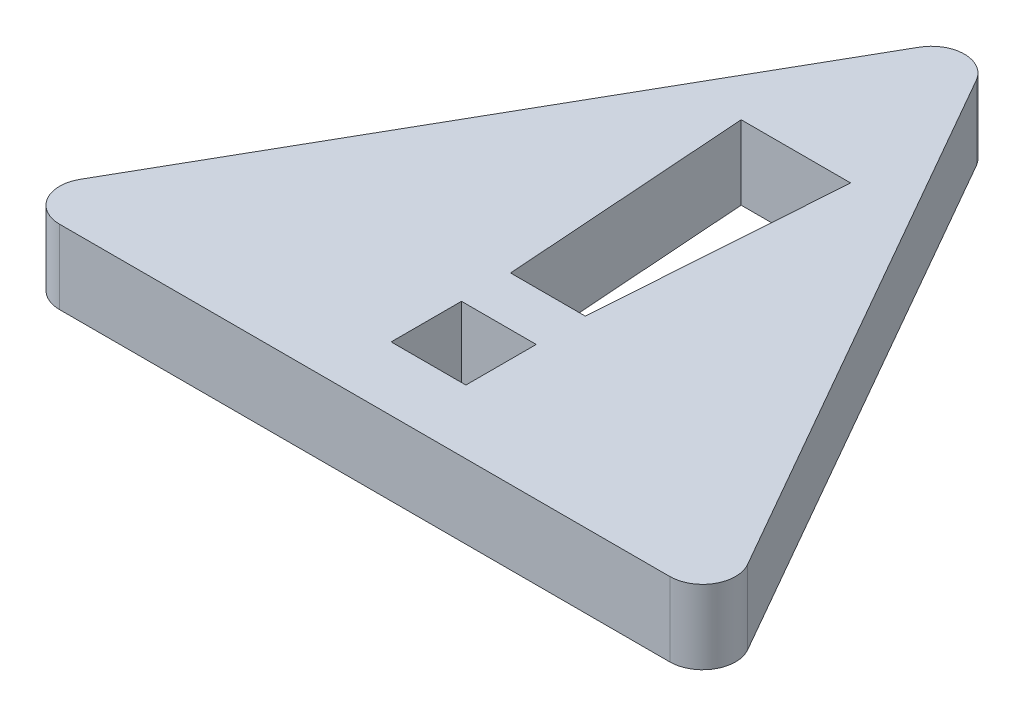
ISO-10303-21;
HEADER;
FILE_DESCRIPTION(('STEP AP214'),'2;1');
FILE_NAME('part.step','',(''),(''),'','','');
FILE_SCHEMA(('AUTOMOTIVE_DESIGN { 1 0 10303 214 1 1 1 1 }'));
ENDSEC;
DATA;
#1=APPLICATION_CONTEXT('core data for automotive mechanical design processes');
#2=APPLICATION_PROTOCOL_DEFINITION('international standard','automotive_design',2000,#1);
#3=PRODUCT_CONTEXT('',#1,'mechanical');
#4=PRODUCT('Part','Part','',(#3));
#5=PRODUCT_RELATED_PRODUCT_CATEGORY('part','',(#4));
#6=PRODUCT_DEFINITION_FORMATION('','',#4);
#7=PRODUCT_DEFINITION_CONTEXT('part definition',#1,'design');
#8=PRODUCT_DEFINITION('design','',#6,#7);
#9=PRODUCT_DEFINITION_SHAPE('','',#8);
#10=(LENGTH_UNIT() NAMED_UNIT(*) SI_UNIT(.MILLI.,.METRE.));
#11=(NAMED_UNIT(*) PLANE_ANGLE_UNIT() SI_UNIT($,.RADIAN.));
#12=(NAMED_UNIT(*) SI_UNIT($,.STERADIAN.) SOLID_ANGLE_UNIT());
#13=UNCERTAINTY_MEASURE_WITH_UNIT(LENGTH_MEASURE(1.E-05),#10,'distance_accuracy_value','');
#14=(GEOMETRIC_REPRESENTATION_CONTEXT(3) GLOBAL_UNCERTAINTY_ASSIGNED_CONTEXT((#13)) GLOBAL_UNIT_ASSIGNED_CONTEXT((#10,
#11,#12)) REPRESENTATION_CONTEXT('',''));
#15=CARTESIAN_POINT('',(0.,0.,0.));
#16=DIRECTION('',(0.,0.,1.));
#17=DIRECTION('',(1.,0.,0.));
#18=AXIS2_PLACEMENT_3D('',#15,#16,#17);
#19=CARTESIAN_POINT('',(0.,2.25,0.));
#20=DIRECTION('',(0.,-1.,0.));
#21=DIRECTION('',(0.,0.,-1.));
#22=AXIS2_PLACEMENT_3D('',#19,#20,#21);
#23=PLANE('',#22);
#24=DIRECTION('',(0.,0.,1.));
#25=VECTOR('',#24,1.);
#26=CARTESIAN_POINT('',(-7.26476447593346,2.25,-5.91742952927736));
#27=LINE('',#26,#25);
#28=CARTESIAN_POINT('',(-7.26476447593346,2.25,-5.91742952927736));
#29=VERTEX_POINT('',#28);
#30=CARTESIAN_POINT('',(-7.26476447593346,2.25,-3.77872924812318));
#31=VERTEX_POINT('',#30);
#32=EDGE_CURVE('E177',#29,#31,#27,.T.);
#33=ORIENTED_EDGE('',*,*,#32,.F.);
#34=DIRECTION('',(-1.,0.,0.));
#35=VECTOR('',#34,1.);
#36=CARTESIAN_POINT('',(-7.26476447593346,2.25,-5.91742952927736));
#37=LINE('',#36,#35);
#38=CARTESIAN_POINT('',(-4.99239542720714,2.25,-5.91742952927736));
#39=VERTEX_POINT('',#38);
#40=EDGE_CURVE('E185',#39,#29,#37,.T.);
#41=ORIENTED_EDGE('',*,*,#40,.F.);
#42=DIRECTION('',(0.,0.,-1.));
#43=VECTOR('',#42,1.);
#44=CARTESIAN_POINT('',(-4.99239542720714,2.25,-5.91742952927736));
#45=LINE('',#44,#43);
#46=CARTESIAN_POINT('',(-4.99239542720714,2.25,-3.77872924812318));
#47=VERTEX_POINT('',#46);
#48=EDGE_CURVE('E182',#47,#39,#45,.T.);
#49=ORIENTED_EDGE('',*,*,#48,.F.);
#50=DIRECTION('',(1.,0.,0.));
#51=VECTOR('',#50,1.);
#52=CARTESIAN_POINT('',(-7.26476447593346,2.25,-3.77872924812318));
#53=LINE('',#52,#51);
#54=EDGE_CURVE('E179',#31,#47,#53,.T.);
#55=ORIENTED_EDGE('',*,*,#54,.F.);
#56=EDGE_LOOP('',(#33,#41,#49,#55));
#57=FACE_BOUND('',#56,.T.);
#58=DIRECTION('',(-0.496138938356834,0.,0.868243142124459));
#59=VECTOR('',#58,1.);
#60=CARTESIAN_POINT('',(-17.1285799515703,2.25,-1.83754386538101));
#61=LINE('',#60,#59);
#62=CARTESIAN_POINT('',(-6.99682309369476,2.25,-19.5681183666632));
#63=VERTEX_POINT('',#62);
#64=CARTESIAN_POINT('',(-16.2736434153664,2.25,-3.33368280373785));
#65=VERTEX_POINT('',#64);
#66=EDGE_CURVE('E213',#63,#65,#61,.T.);
#67=ORIENTED_EDGE('',*,*,#66,.T.);
#68=CARTESIAN_POINT('',(-15.4054002732419,2.25,-2.83754386538101));
#69=DIRECTION('',(0.,-1.,0.));
#70=DIRECTION('',(0.,0.,-1.));
#71=AXIS2_PLACEMENT_3D('',#68,#69,#70);
#72=CIRCLE('',#71,1.);
#73=CARTESIAN_POINT('',(-15.4054002732419,2.25,-1.83754386538101));
#74=VERTEX_POINT('',#73);
#75=EDGE_CURVE('E241',#65,#74,#72,.F.);
#76=ORIENTED_EDGE('',*,*,#75,.T.);
#77=DIRECTION('',(1.,0.,0.));
#78=VECTOR('',#77,1.);
#79=CARTESIAN_POINT('',(4.8714200484297,2.25,-1.83754386538102));
#80=LINE('',#79,#78);
#81=CARTESIAN_POINT('',(3.14824037010133,2.25,-1.83754386538102));
#82=VERTEX_POINT('',#81);
#83=EDGE_CURVE('E208',#74,#82,#80,.T.);
#84=ORIENTED_EDGE('',*,*,#83,.T.);
#85=CARTESIAN_POINT('',(3.14824037010133,2.25,-2.83754386538102));
#86=DIRECTION('',(0.,-1.,0.));
#87=DIRECTION('',(0.,0.,-1.));
#88=AXIS2_PLACEMENT_3D('',#85,#86,#87);
#89=CIRCLE('',#88,1.);
#90=CARTESIAN_POINT('',(4.01648351222579,2.25,-3.33368280373785));
#91=VERTEX_POINT('',#90);
#92=EDGE_CURVE('E54',#82,#91,#89,.F.);
#93=ORIENTED_EDGE('',*,*,#92,.T.);
#94=DIRECTION('',(-0.496138938356834,0.,-0.868243142124459));
#95=VECTOR('',#94,1.);
#96=CARTESIAN_POINT('',(-6.1285799515703,2.25,-21.087543865381));
#97=LINE('',#96,#95);
#98=CARTESIAN_POINT('',(-5.26033680944584,2.25,-19.5681183666632));
#99=VERTEX_POINT('',#98);
#100=EDGE_CURVE('E210',#91,#99,#97,.T.);
#101=ORIENTED_EDGE('',*,*,#100,.T.);
#102=CARTESIAN_POINT('',(-6.1285799515703,2.25,-19.0719794283064));
#103=DIRECTION('',(0.,-1.,0.));
#104=DIRECTION('',(0.,0.,-1.));
#105=AXIS2_PLACEMENT_3D('',#102,#103,#104);
#106=CIRCLE('',#105,1.);
#107=EDGE_CURVE('E238',#99,#63,#106,.F.);
#108=ORIENTED_EDGE('',*,*,#107,.T.);
#109=EDGE_LOOP('',(#67,#76,#84,#93,#101,#108));
#110=FACE_BOUND('',#109,.T.);
#111=DIRECTION('',(0.0699090616099368,0.,0.997553368549682));
#112=VECTOR('',#111,1.);
#113=CARTESIAN_POINT('',(-7.26476447593346,2.25,-7.40894721271259));
#114=LINE('',#113,#112);
#115=CARTESIAN_POINT('',(-7.79321270201536,2.25,-14.9495334527827));
#116=VERTEX_POINT('',#115);
#117=CARTESIAN_POINT('',(-7.26476447593346,2.25,-7.40894721271259));
#118=VERTEX_POINT('',#117);
#119=EDGE_CURVE('E136',#116,#118,#114,.T.);
#120=ORIENTED_EDGE('',*,*,#119,.F.);
#121=DIRECTION('',(-1.,0.,0.));
#122=VECTOR('',#121,1.);
#123=CARTESIAN_POINT('',(-7.79321270201536,2.25,-14.9495334527827));
#124=LINE('',#123,#122);
#125=CARTESIAN_POINT('',(-4.46394720112524,2.25,-14.9495334527827));
#126=VERTEX_POINT('',#125);
#127=EDGE_CURVE('E161',#126,#116,#124,.T.);
#128=ORIENTED_EDGE('',*,*,#127,.F.);
#129=DIRECTION('',(0.0699090616099362,0.,-0.997553368549682));
#130=VECTOR('',#129,1.);
#131=CARTESIAN_POINT('',(-4.99239542720714,2.25,-7.40894721271259));
#132=LINE('',#131,#130);
#133=CARTESIAN_POINT('',(-4.99239542720714,2.25,-7.40894721271259));
#134=VERTEX_POINT('',#133);
#135=EDGE_CURVE('E159',#134,#126,#132,.T.);
#136=ORIENTED_EDGE('',*,*,#135,.F.);
#137=DIRECTION('',(1.,0.,0.));
#138=VECTOR('',#137,1.);
#139=CARTESIAN_POINT('',(-7.26476447593346,2.25,-7.40894721271259));
#140=LINE('',#139,#138);
#141=EDGE_CURVE('E146',#118,#134,#140,.T.);
#142=ORIENTED_EDGE('',*,*,#141,.F.);
#143=EDGE_LOOP('',(#120,#128,#136,#142));
#144=FACE_BOUND('',#143,.T.);
#145=ADVANCED_FACE('F33',(#57,#110,#144),#23,.F.);
#146=CARTESIAN_POINT('',(0.,0.,0.));
#147=DIRECTION('',(0.,-1.,0.));
#148=DIRECTION('',(0.,0.,-1.));
#149=AXIS2_PLACEMENT_3D('',#146,#147,#148);
#150=PLANE('',#149);
#151=DIRECTION('',(1.,0.,0.));
#152=VECTOR('',#151,1.);
#153=CARTESIAN_POINT('',(4.8714200484297,0.,-1.83754386538102));
#154=LINE('',#153,#152);
#155=CARTESIAN_POINT('',(-15.4054002732419,0.,-1.83754386538101));
#156=VERTEX_POINT('',#155);
#157=CARTESIAN_POINT('',(3.14824037010133,0.,-1.83754386538102));
#158=VERTEX_POINT('',#157);
#159=EDGE_CURVE('E207',#156,#158,#154,.T.);
#160=ORIENTED_EDGE('',*,*,#159,.F.);
#161=CARTESIAN_POINT('',(-15.4054002732419,0.,-2.83754386538101));
#162=DIRECTION('',(0.,-1.,0.));
#163=DIRECTION('',(0.,0.,-1.));
#164=AXIS2_PLACEMENT_3D('',#161,#162,#163);
#165=CIRCLE('',#164,1.);
#166=CARTESIAN_POINT('',(-16.2736434153664,0.,-3.33368280373785));
#167=VERTEX_POINT('',#166);
#168=EDGE_CURVE('E231',#156,#167,#165,.T.);
#169=ORIENTED_EDGE('',*,*,#168,.T.);
#170=DIRECTION('',(-0.496138938356834,0.,0.868243142124459));
#171=VECTOR('',#170,1.);
#172=CARTESIAN_POINT('',(-17.1285799515703,0.,-1.83754386538101));
#173=LINE('',#172,#171);
#174=CARTESIAN_POINT('',(-6.99682309369476,0.,-19.5681183666632));
#175=VERTEX_POINT('',#174);
#176=EDGE_CURVE('E211',#175,#167,#173,.T.);
#177=ORIENTED_EDGE('',*,*,#176,.F.);
#178=CARTESIAN_POINT('',(-6.1285799515703,0.,-19.0719794283064));
#179=DIRECTION('',(0.,-1.,0.));
#180=DIRECTION('',(0.,0.,-1.));
#181=AXIS2_PLACEMENT_3D('',#178,#179,#180);
#182=CIRCLE('',#181,1.);
#183=CARTESIAN_POINT('',(-5.26033680944584,0.,-19.5681183666632));
#184=VERTEX_POINT('',#183);
#185=EDGE_CURVE('E227',#175,#184,#182,.T.);
#186=ORIENTED_EDGE('',*,*,#185,.T.);
#187=DIRECTION('',(-0.496138938356834,0.,-0.868243142124459));
#188=VECTOR('',#187,1.);
#189=CARTESIAN_POINT('',(-6.1285799515703,0.,-21.087543865381));
#190=LINE('',#189,#188);
#191=CARTESIAN_POINT('',(4.01648351222579,0.,-3.33368280373785));
#192=VERTEX_POINT('',#191);
#193=EDGE_CURVE('E219',#192,#184,#190,.T.);
#194=ORIENTED_EDGE('',*,*,#193,.F.);
#195=CARTESIAN_POINT('',(3.14824037010133,0.,-2.83754386538102));
#196=DIRECTION('',(0.,-1.,0.));
#197=DIRECTION('',(0.,0.,-1.));
#198=AXIS2_PLACEMENT_3D('',#195,#196,#197);
#199=CIRCLE('',#198,1.);
#200=EDGE_CURVE('E229',#192,#158,#199,.T.);
#201=ORIENTED_EDGE('',*,*,#200,.T.);
#202=EDGE_LOOP('',(#160,#169,#177,#186,#194,#201));
#203=FACE_BOUND('',#202,.T.);
#204=DIRECTION('',(-1.,0.,0.));
#205=VECTOR('',#204,1.);
#206=CARTESIAN_POINT('',(-7.26476447593346,0.,-5.91742952927736));
#207=LINE('',#206,#205);
#208=CARTESIAN_POINT('',(-4.99239542720714,0.,-5.91742952927736));
#209=VERTEX_POINT('',#208);
#210=CARTESIAN_POINT('',(-7.26476447593346,0.,-5.91742952927736));
#211=VERTEX_POINT('',#210);
#212=EDGE_CURVE('E180',#209,#211,#207,.T.);
#213=ORIENTED_EDGE('',*,*,#212,.T.);
#214=DIRECTION('',(0.,0.,1.));
#215=VECTOR('',#214,1.);
#216=CARTESIAN_POINT('',(-7.26476447593346,0.,-5.91742952927736));
#217=LINE('',#216,#215);
#218=CARTESIAN_POINT('',(-7.26476447593346,0.,-3.77872924812318));
#219=VERTEX_POINT('',#218);
#220=EDGE_CURVE('E154',#211,#219,#217,.T.);
#221=ORIENTED_EDGE('',*,*,#220,.T.);
#222=DIRECTION('',(1.,0.,0.));
#223=VECTOR('',#222,1.);
#224=CARTESIAN_POINT('',(-7.26476447593346,0.,-3.77872924812318));
#225=LINE('',#224,#223);
#226=CARTESIAN_POINT('',(-4.99239542720714,0.,-3.77872924812318));
#227=VERTEX_POINT('',#226);
#228=EDGE_CURVE('E190',#219,#227,#225,.T.);
#229=ORIENTED_EDGE('',*,*,#228,.T.);
#230=DIRECTION('',(0.,0.,-1.));
#231=VECTOR('',#230,1.);
#232=CARTESIAN_POINT('',(-4.99239542720714,0.,-5.91742952927736));
#233=LINE('',#232,#231);
#234=EDGE_CURVE('E193',#227,#209,#233,.T.);
#235=ORIENTED_EDGE('',*,*,#234,.T.);
#236=EDGE_LOOP('',(#213,#221,#229,#235));
#237=FACE_BOUND('',#236,.T.);
#238=DIRECTION('',(-1.,0.,0.));
#239=VECTOR('',#238,1.);
#240=CARTESIAN_POINT('',(-7.79321270201536,0.,-14.9495334527827));
#241=LINE('',#240,#239);
#242=CARTESIAN_POINT('',(-4.46394720112524,0.,-14.9495334527827));
#243=VERTEX_POINT('',#242);
#244=CARTESIAN_POINT('',(-7.79321270201536,0.,-14.9495334527827));
#245=VERTEX_POINT('',#244);
#246=EDGE_CURVE('E147',#243,#245,#241,.T.);
#247=ORIENTED_EDGE('',*,*,#246,.T.);
#248=DIRECTION('',(0.0699090616099368,0.,0.997553368549682));
#249=VECTOR('',#248,1.);
#250=CARTESIAN_POINT('',(-7.26476447593346,0.,-7.40894721271259));
#251=LINE('',#250,#249);
#252=CARTESIAN_POINT('',(-7.26476447593346,0.,-7.40894721271259));
#253=VERTEX_POINT('',#252);
#254=EDGE_CURVE('E165',#245,#253,#251,.T.);
#255=ORIENTED_EDGE('',*,*,#254,.T.);
#256=DIRECTION('',(1.,0.,0.));
#257=VECTOR('',#256,1.);
#258=CARTESIAN_POINT('',(-7.26476447593346,0.,-7.40894721271259));
#259=LINE('',#258,#257);
#260=CARTESIAN_POINT('',(-4.99239542720714,0.,-7.40894721271259));
#261=VERTEX_POINT('',#260);
#262=EDGE_CURVE('E153',#253,#261,#259,.T.);
#263=ORIENTED_EDGE('',*,*,#262,.T.);
#264=DIRECTION('',(0.0699090616099362,0.,-0.997553368549682));
#265=VECTOR('',#264,1.);
#266=CARTESIAN_POINT('',(-4.99239542720714,0.,-7.40894721271259));
#267=LINE('',#266,#265);
#268=EDGE_CURVE('E168',#261,#243,#267,.T.);
#269=ORIENTED_EDGE('',*,*,#268,.T.);
#270=EDGE_LOOP('',(#247,#255,#263,#269));
#271=FACE_BOUND('',#270,.T.);
#272=ADVANCED_FACE('F255',(#203,#237,#271),#150,.T.);
#273=CARTESIAN_POINT('',(4.8714200484297,2.25,-1.83754386538102));
#274=DIRECTION('',(0.,0.,-1.));
#275=DIRECTION('',(-1.,0.,0.));
#276=AXIS2_PLACEMENT_3D('',#273,#274,#275);
#277=PLANE('',#276);
#278=ORIENTED_EDGE('',*,*,#83,.F.);
#279=DIRECTION('',(0.,-1.,0.));
#280=VECTOR('',#279,1.);
#281=CARTESIAN_POINT('',(-15.4054002732419,2.25,-1.83754386538101));
#282=LINE('',#281,#280);
#283=EDGE_CURVE('E224',#74,#156,#282,.T.);
#284=ORIENTED_EDGE('',*,*,#283,.T.);
#285=ORIENTED_EDGE('',*,*,#159,.T.);
#286=DIRECTION('',(0.,-1.,0.));
#287=VECTOR('',#286,1.);
#288=CARTESIAN_POINT('',(3.14824037010133,2.25,-1.83754386538102));
#289=LINE('',#288,#287);
#290=EDGE_CURVE('E216',#158,#82,#289,.F.);
#291=ORIENTED_EDGE('',*,*,#290,.T.);
#292=EDGE_LOOP('',(#278,#284,#285,#291));
#293=FACE_BOUND('',#292,.T.);
#294=ADVANCED_FACE('F249',(#293),#277,.F.);
#295=CARTESIAN_POINT('',(-6.1285799515703,2.25,-21.087543865381));
#296=DIRECTION('',(-0.868243142124459,0.,0.496138938356834));
#297=DIRECTION('',(0.496138938356834,0.,0.868243142124459));
#298=AXIS2_PLACEMENT_3D('',#295,#296,#297);
#299=PLANE('',#298);
#300=ORIENTED_EDGE('',*,*,#100,.F.);
#301=DIRECTION('',(0.,-1.,0.));
#302=VECTOR('',#301,1.);
#303=CARTESIAN_POINT('',(4.01648351222579,2.25,-3.33368280373785));
#304=LINE('',#303,#302);
#305=EDGE_CURVE('E11',#91,#192,#304,.T.);
#306=ORIENTED_EDGE('',*,*,#305,.T.);
#307=ORIENTED_EDGE('',*,*,#193,.T.);
#308=DIRECTION('',(0.,-1.,0.));
#309=VECTOR('',#308,1.);
#310=CARTESIAN_POINT('',(-5.26033680944584,2.25,-19.5681183666632));
#311=LINE('',#310,#309);
#312=EDGE_CURVE('E41',#184,#99,#311,.F.);
#313=ORIENTED_EDGE('',*,*,#312,.T.);
#314=EDGE_LOOP('',(#300,#306,#307,#313));
#315=FACE_BOUND('',#314,.T.);
#316=ADVANCED_FACE('F263',(#315),#299,.F.);
#317=CARTESIAN_POINT('',(-17.1285799515703,2.25,-1.83754386538101));
#318=DIRECTION('',(0.868243142124459,0.,0.496138938356834));
#319=DIRECTION('',(0.496138938356834,0.,-0.868243142124459));
#320=AXIS2_PLACEMENT_3D('',#317,#318,#319);
#321=PLANE('',#320);
#322=ORIENTED_EDGE('',*,*,#176,.T.);
#323=DIRECTION('',(0.,-1.,0.));
#324=VECTOR('',#323,1.);
#325=CARTESIAN_POINT('',(-16.2736434153664,2.25,-3.33368280373785));
#326=LINE('',#325,#324);
#327=EDGE_CURVE('E236',#167,#65,#326,.F.);
#328=ORIENTED_EDGE('',*,*,#327,.T.);
#329=ORIENTED_EDGE('',*,*,#66,.F.);
#330=DIRECTION('',(0.,-1.,0.));
#331=VECTOR('',#330,1.);
#332=CARTESIAN_POINT('',(-6.99682309369476,2.25,-19.5681183666632));
#333=LINE('',#332,#331);
#334=EDGE_CURVE('E233',#63,#175,#333,.T.);
#335=ORIENTED_EDGE('',*,*,#334,.T.);
#336=EDGE_LOOP('',(#322,#328,#329,#335));
#337=FACE_BOUND('',#336,.T.);
#338=ADVANCED_FACE('F258',(#337),#321,.F.);
#339=CARTESIAN_POINT('',(-7.26476447593346,2.25,-5.91742952927736));
#340=DIRECTION('',(1.,0.,0.));
#341=DIRECTION('',(0.,0.,-1.));
#342=AXIS2_PLACEMENT_3D('',#339,#340,#341);
#343=PLANE('',#342);
#344=ORIENTED_EDGE('',*,*,#220,.F.);
#345=DIRECTION('',(0.,-1.,0.));
#346=VECTOR('',#345,1.);
#347=CARTESIAN_POINT('',(-7.26476447593346,2.25,-5.91742952927736));
#348=LINE('',#347,#346);
#349=EDGE_CURVE('E187',#29,#211,#348,.T.);
#350=ORIENTED_EDGE('',*,*,#349,.F.);
#351=ORIENTED_EDGE('',*,*,#32,.T.);
#352=DIRECTION('',(0.,-1.,0.));
#353=VECTOR('',#352,1.);
#354=CARTESIAN_POINT('',(-7.26476447593346,2.25,-3.77872924812318));
#355=LINE('',#354,#353);
#356=EDGE_CURVE('E204',#31,#219,#355,.T.);
#357=ORIENTED_EDGE('',*,*,#356,.T.);
#358=EDGE_LOOP('',(#344,#350,#351,#357));
#359=FACE_BOUND('',#358,.T.);
#360=ADVANCED_FACE('F283',(#359),#343,.T.);
#361=CARTESIAN_POINT('',(-7.26476447593346,2.25,-3.77872924812318));
#362=DIRECTION('',(0.,0.,-1.));
#363=DIRECTION('',(-1.,0.,0.));
#364=AXIS2_PLACEMENT_3D('',#361,#362,#363);
#365=PLANE('',#364);
#366=ORIENTED_EDGE('',*,*,#228,.F.);
#367=ORIENTED_EDGE('',*,*,#356,.F.);
#368=ORIENTED_EDGE('',*,*,#54,.T.);
#369=DIRECTION('',(0.,-1.,0.));
#370=VECTOR('',#369,1.);
#371=CARTESIAN_POINT('',(-4.99239542720714,2.25,-3.77872924812318));
#372=LINE('',#371,#370);
#373=EDGE_CURVE('E202',#47,#227,#372,.T.);
#374=ORIENTED_EDGE('',*,*,#373,.T.);
#375=EDGE_LOOP('',(#366,#367,#368,#374));
#376=FACE_BOUND('',#375,.T.);
#377=ADVANCED_FACE('F310',(#376),#365,.T.);
#378=CARTESIAN_POINT('',(-4.99239542720714,2.25,-5.91742952927736));
#379=DIRECTION('',(-1.,0.,0.));
#380=DIRECTION('',(0.,0.,1.));
#381=AXIS2_PLACEMENT_3D('',#378,#379,#380);
#382=PLANE('',#381);
#383=ORIENTED_EDGE('',*,*,#234,.F.);
#384=ORIENTED_EDGE('',*,*,#373,.F.);
#385=ORIENTED_EDGE('',*,*,#48,.T.);
#386=DIRECTION('',(0.,-1.,0.));
#387=VECTOR('',#386,1.);
#388=CARTESIAN_POINT('',(-4.99239542720714,2.25,-5.91742952927736));
#389=LINE('',#388,#387);
#390=EDGE_CURVE('E200',#39,#209,#389,.T.);
#391=ORIENTED_EDGE('',*,*,#390,.T.);
#392=EDGE_LOOP('',(#383,#384,#385,#391));
#393=FACE_BOUND('',#392,.T.);
#394=ADVANCED_FACE('F317',(#393),#382,.T.);
#395=CARTESIAN_POINT('',(-7.26476447593346,2.25,-5.91742952927736));
#396=DIRECTION('',(0.,0.,1.));
#397=DIRECTION('',(1.,0.,0.));
#398=AXIS2_PLACEMENT_3D('',#395,#396,#397);
#399=PLANE('',#398);
#400=ORIENTED_EDGE('',*,*,#212,.F.);
#401=ORIENTED_EDGE('',*,*,#390,.F.);
#402=ORIENTED_EDGE('',*,*,#40,.T.);
#403=ORIENTED_EDGE('',*,*,#349,.T.);
#404=EDGE_LOOP('',(#400,#401,#402,#403));
#405=FACE_BOUND('',#404,.T.);
#406=ADVANCED_FACE('F324',(#405),#399,.T.);
#407=CARTESIAN_POINT('',(-7.26476447593346,2.25,-7.40894721271259));
#408=DIRECTION('',(0.997553368549682,0.,-0.0699090616099368));
#409=DIRECTION('',(-0.0699090616099368,0.,-0.997553368549682));
#410=AXIS2_PLACEMENT_3D('',#407,#408,#409);
#411=PLANE('',#410);
#412=ORIENTED_EDGE('',*,*,#254,.F.);
#413=DIRECTION('',(0.,-1.,0.));
#414=VECTOR('',#413,1.);
#415=CARTESIAN_POINT('',(-7.79321270201536,2.25,-14.9495334527827));
#416=LINE('',#415,#414);
#417=EDGE_CURVE('E142',#116,#245,#416,.T.);
#418=ORIENTED_EDGE('',*,*,#417,.F.);
#419=ORIENTED_EDGE('',*,*,#119,.T.);
#420=DIRECTION('',(0.,-1.,0.));
#421=VECTOR('',#420,1.);
#422=CARTESIAN_POINT('',(-7.26476447593346,2.25,-7.40894721271259));
#423=LINE('',#422,#421);
#424=EDGE_CURVE('E139',#118,#253,#423,.T.);
#425=ORIENTED_EDGE('',*,*,#424,.T.);
#426=EDGE_LOOP('',(#412,#418,#419,#425));
#427=FACE_BOUND('',#426,.T.);
#428=ADVANCED_FACE('F138',(#427),#411,.T.);
#429=CARTESIAN_POINT('',(-7.26476447593346,2.25,-7.40894721271259));
#430=DIRECTION('',(0.,0.,-1.));
#431=DIRECTION('',(-1.,0.,0.));
#432=AXIS2_PLACEMENT_3D('',#429,#430,#431);
#433=PLANE('',#432);
#434=ORIENTED_EDGE('',*,*,#262,.F.);
#435=ORIENTED_EDGE('',*,*,#424,.F.);
#436=ORIENTED_EDGE('',*,*,#141,.T.);
#437=DIRECTION('',(0.,-1.,0.));
#438=VECTOR('',#437,1.);
#439=CARTESIAN_POINT('',(-4.99239542720714,2.25,-7.40894721271259));
#440=LINE('',#439,#438);
#441=EDGE_CURVE('E155',#134,#261,#440,.T.);
#442=ORIENTED_EDGE('',*,*,#441,.T.);
#443=EDGE_LOOP('',(#434,#435,#436,#442));
#444=FACE_BOUND('',#443,.T.);
#445=ADVANCED_FACE('F150',(#444),#433,.T.);
#446=CARTESIAN_POINT('',(-4.99239542720714,2.25,-7.40894721271259));
#447=DIRECTION('',(-0.997553368549682,0.,-0.0699090616099362));
#448=DIRECTION('',(-0.0699090616099362,0.,0.997553368549682));
#449=AXIS2_PLACEMENT_3D('',#446,#447,#448);
#450=PLANE('',#449);
#451=ORIENTED_EDGE('',*,*,#268,.F.);
#452=ORIENTED_EDGE('',*,*,#441,.F.);
#453=ORIENTED_EDGE('',*,*,#135,.T.);
#454=DIRECTION('',(0.,-1.,0.));
#455=VECTOR('',#454,1.);
#456=CARTESIAN_POINT('',(-4.46394720112524,2.25,-14.9495334527827));
#457=LINE('',#456,#455);
#458=EDGE_CURVE('E174',#126,#243,#457,.T.);
#459=ORIENTED_EDGE('',*,*,#458,.T.);
#460=EDGE_LOOP('',(#451,#452,#453,#459));
#461=FACE_BOUND('',#460,.T.);
#462=ADVANCED_FACE('F345',(#461),#450,.T.);
#463=CARTESIAN_POINT('',(-7.79321270201536,2.25,-14.9495334527827));
#464=DIRECTION('',(0.,0.,1.));
#465=DIRECTION('',(1.,0.,0.));
#466=AXIS2_PLACEMENT_3D('',#463,#464,#465);
#467=PLANE('',#466);
#468=ORIENTED_EDGE('',*,*,#246,.F.);
#469=ORIENTED_EDGE('',*,*,#458,.F.);
#470=ORIENTED_EDGE('',*,*,#127,.T.);
#471=ORIENTED_EDGE('',*,*,#417,.T.);
#472=EDGE_LOOP('',(#468,#469,#470,#471));
#473=FACE_BOUND('',#472,.T.);
#474=ADVANCED_FACE('F272',(#473),#467,.T.);
#475=CARTESIAN_POINT('',(-15.4054002732419,2.25,-2.83754386538101));
#476=DIRECTION('',(0.,-1.,0.));
#477=DIRECTION('',(0.,0.,-1.));
#478=AXIS2_PLACEMENT_3D('',#475,#476,#477);
#479=CYLINDRICAL_SURFACE('',#478,1.);
#480=ORIENTED_EDGE('',*,*,#75,.F.);
#481=ORIENTED_EDGE('',*,*,#327,.F.);
#482=ORIENTED_EDGE('',*,*,#168,.F.);
#483=ORIENTED_EDGE('',*,*,#283,.F.);
#484=EDGE_LOOP('',(#480,#481,#482,#483));
#485=FACE_BOUND('',#484,.T.);
#486=ADVANCED_FACE('F252',(#485),#479,.T.);
#487=CARTESIAN_POINT('',(3.14824037010133,2.25,-2.83754386538102));
#488=DIRECTION('',(0.,-1.,0.));
#489=DIRECTION('',(0.,0.,-1.));
#490=AXIS2_PLACEMENT_3D('',#487,#488,#489);
#491=CYLINDRICAL_SURFACE('',#490,1.);
#492=ORIENTED_EDGE('',*,*,#92,.F.);
#493=ORIENTED_EDGE('',*,*,#290,.F.);
#494=ORIENTED_EDGE('',*,*,#200,.F.);
#495=ORIENTED_EDGE('',*,*,#305,.F.);
#496=EDGE_LOOP('',(#492,#493,#494,#495));
#497=FACE_BOUND('',#496,.T.);
#498=ADVANCED_FACE('F266',(#497),#491,.T.);
#499=CARTESIAN_POINT('',(-6.1285799515703,2.25,-19.0719794283064));
#500=DIRECTION('',(0.,-1.,0.));
#501=DIRECTION('',(0.,0.,-1.));
#502=AXIS2_PLACEMENT_3D('',#499,#500,#501);
#503=CYLINDRICAL_SURFACE('',#502,1.);
#504=ORIENTED_EDGE('',*,*,#107,.F.);
#505=ORIENTED_EDGE('',*,*,#312,.F.);
#506=ORIENTED_EDGE('',*,*,#185,.F.);
#507=ORIENTED_EDGE('',*,*,#334,.F.);
#508=EDGE_LOOP('',(#504,#505,#506,#507));
#509=FACE_BOUND('',#508,.T.);
#510=ADVANCED_FACE('F35',(#509),#503,.T.);
#511=CLOSED_SHELL('',(#145,#272,#294,#316,#338,#360,#377,#394,#406,#428,#445,#462,#474,#486,
#498,#510));
#512=MANIFOLD_SOLID_BREP('B2',#511);
#513=ADVANCED_BREP_SHAPE_REPRESENTATION('',(#18,#512),#14);
#514=SHAPE_DEFINITION_REPRESENTATION(#9,#513);
ENDSEC;
END-ISO-10303-21;
